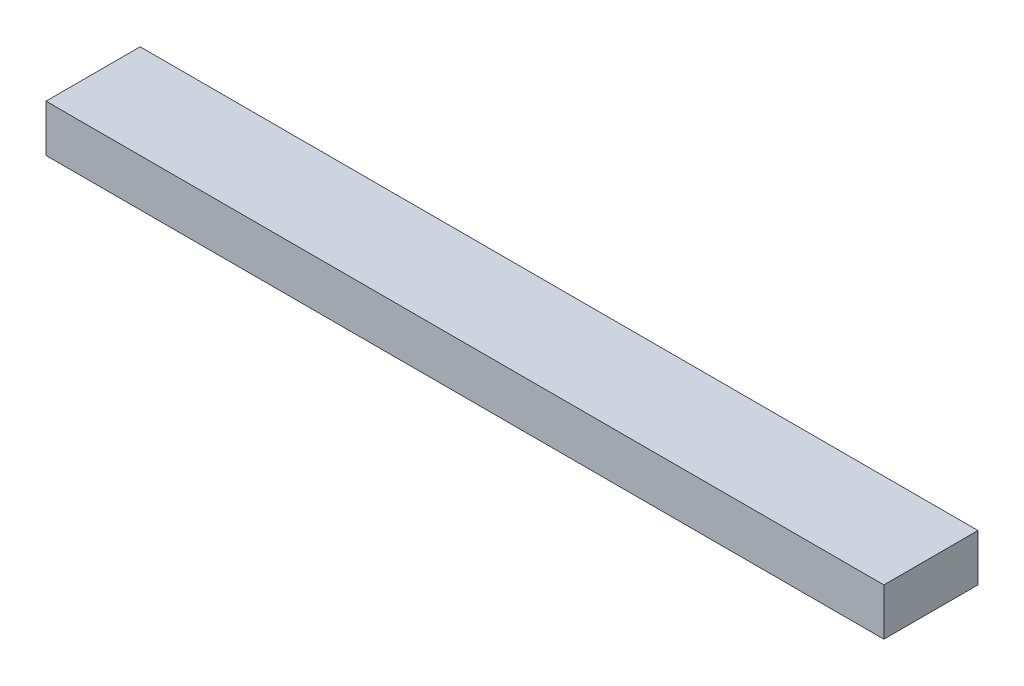
ISO-10303-21;
HEADER;
FILE_DESCRIPTION(('STEP AP214'),'2;1');
FILE_NAME('part.step','',(''),(''),'','','');
FILE_SCHEMA(('AUTOMOTIVE_DESIGN { 1 0 10303 214 1 1 1 1 }'));
ENDSEC;
DATA;
#1=APPLICATION_CONTEXT('core data for automotive mechanical design processes');
#2=APPLICATION_PROTOCOL_DEFINITION('international standard','automotive_design',2000,#1);
#3=PRODUCT_CONTEXT('',#1,'mechanical');
#4=PRODUCT('Part','Part','',(#3));
#5=PRODUCT_RELATED_PRODUCT_CATEGORY('part','',(#4));
#6=PRODUCT_DEFINITION_FORMATION('','',#4);
#7=PRODUCT_DEFINITION_CONTEXT('part definition',#1,'design');
#8=PRODUCT_DEFINITION('design','',#6,#7);
#9=PRODUCT_DEFINITION_SHAPE('','',#8);
#10=(LENGTH_UNIT() NAMED_UNIT(*) SI_UNIT(.MILLI.,.METRE.));
#11=(NAMED_UNIT(*) PLANE_ANGLE_UNIT() SI_UNIT($,.RADIAN.));
#12=(NAMED_UNIT(*) SI_UNIT($,.STERADIAN.) SOLID_ANGLE_UNIT());
#13=UNCERTAINTY_MEASURE_WITH_UNIT(LENGTH_MEASURE(1.E-05),#10,'distance_accuracy_value','');
#14=(GEOMETRIC_REPRESENTATION_CONTEXT(3) GLOBAL_UNCERTAINTY_ASSIGNED_CONTEXT((#13)) GLOBAL_UNIT_ASSIGNED_CONTEXT((#10,
#11,#12)) REPRESENTATION_CONTEXT('',''));
#15=CARTESIAN_POINT('',(0.,0.,0.));
#16=DIRECTION('',(0.,0.,1.));
#17=DIRECTION('',(1.,0.,0.));
#18=AXIS2_PLACEMENT_3D('',#15,#16,#17);
#19=CARTESIAN_POINT('',(-1780.,-50.,100.));
#20=DIRECTION('',(0.,0.,1.));
#21=DIRECTION('',(1.,0.,0.));
#22=AXIS2_PLACEMENT_3D('',#19,#20,#21);
#23=PLANE('',#22);
#24=DIRECTION('',(0.,-1.,0.));
#25=VECTOR('',#24,1.);
#26=CARTESIAN_POINT('',(0.,-50.,100.));
#27=LINE('',#26,#25);
#28=CARTESIAN_POINT('',(0.,50.,100.));
#29=VERTEX_POINT('',#28);
#30=CARTESIAN_POINT('',(0.,-50.,100.));
#31=VERTEX_POINT('',#30);
#32=EDGE_CURVE('E100',#29,#31,#27,.T.);
#33=ORIENTED_EDGE('',*,*,#32,.F.);
#34=DIRECTION('',(1.,0.,0.));
#35=VECTOR('',#34,1.);
#36=CARTESIAN_POINT('',(-1780.,50.,100.));
#37=LINE('',#36,#35);
#38=CARTESIAN_POINT('',(-1780.,50.,100.));
#39=VERTEX_POINT('',#38);
#40=EDGE_CURVE('E11',#39,#29,#37,.T.);
#41=ORIENTED_EDGE('',*,*,#40,.F.);
#42=DIRECTION('',(0.,-1.,0.));
#43=VECTOR('',#42,1.);
#44=CARTESIAN_POINT('',(-1780.,-50.,100.));
#45=LINE('',#44,#43);
#46=CARTESIAN_POINT('',(-1780.,-50.,100.));
#47=VERTEX_POINT('',#46);
#48=EDGE_CURVE('E94',#39,#47,#45,.T.);
#49=ORIENTED_EDGE('',*,*,#48,.T.);
#50=DIRECTION('',(1.,0.,0.));
#51=VECTOR('',#50,1.);
#52=CARTESIAN_POINT('',(-1780.,-50.,100.));
#53=LINE('',#52,#51);
#54=EDGE_CURVE('E39',#47,#31,#53,.T.);
#55=ORIENTED_EDGE('',*,*,#54,.T.);
#56=EDGE_LOOP('',(#33,#41,#49,#55));
#57=FACE_BOUND('',#56,.T.);
#58=ADVANCED_FACE('F36',(#57),#23,.T.);
#59=CARTESIAN_POINT('',(-1780.,50.,-100.));
#60=DIRECTION('',(0.,1.,0.));
#61=DIRECTION('',(0.,0.,1.));
#62=AXIS2_PLACEMENT_3D('',#59,#60,#61);
#63=PLANE('',#62);
#64=DIRECTION('',(0.,0.,1.));
#65=VECTOR('',#64,1.);
#66=CARTESIAN_POINT('',(0.,50.,-100.));
#67=LINE('',#66,#65);
#68=CARTESIAN_POINT('',(0.,50.,-100.));
#69=VERTEX_POINT('',#68);
#70=EDGE_CURVE('E96',#69,#29,#67,.T.);
#71=ORIENTED_EDGE('',*,*,#70,.F.);
#72=DIRECTION('',(1.,0.,0.));
#73=VECTOR('',#72,1.);
#74=CARTESIAN_POINT('',(-1780.,50.,-100.));
#75=LINE('',#74,#73);
#76=CARTESIAN_POINT('',(-1780.,50.,-100.));
#77=VERTEX_POINT('',#76);
#78=EDGE_CURVE('E45',#77,#69,#75,.T.);
#79=ORIENTED_EDGE('',*,*,#78,.F.);
#80=DIRECTION('',(0.,0.,1.));
#81=VECTOR('',#80,1.);
#82=CARTESIAN_POINT('',(-1780.,50.,-100.));
#83=LINE('',#82,#81);
#84=EDGE_CURVE('E91',#77,#39,#83,.T.);
#85=ORIENTED_EDGE('',*,*,#84,.T.);
#86=ORIENTED_EDGE('',*,*,#40,.T.);
#87=EDGE_LOOP('',(#71,#79,#85,#86));
#88=FACE_BOUND('',#87,.T.);
#89=ADVANCED_FACE('F110',(#88),#63,.T.);
#90=CARTESIAN_POINT('',(-1780.,-50.,-100.));
#91=DIRECTION('',(0.,0.,-1.));
#92=DIRECTION('',(-1.,0.,0.));
#93=AXIS2_PLACEMENT_3D('',#90,#91,#92);
#94=PLANE('',#93);
#95=DIRECTION('',(0.,1.,0.));
#96=VECTOR('',#95,1.);
#97=CARTESIAN_POINT('',(0.,-50.,-100.));
#98=LINE('',#97,#96);
#99=CARTESIAN_POINT('',(0.,-50.,-100.));
#100=VERTEX_POINT('',#99);
#101=EDGE_CURVE('E86',#100,#69,#98,.T.);
#102=ORIENTED_EDGE('',*,*,#101,.F.);
#103=DIRECTION('',(1.,0.,0.));
#104=VECTOR('',#103,1.);
#105=CARTESIAN_POINT('',(-1780.,-50.,-100.));
#106=LINE('',#105,#104);
#107=CARTESIAN_POINT('',(-1780.,-50.,-100.));
#108=VERTEX_POINT('',#107);
#109=EDGE_CURVE('E81',#108,#100,#106,.T.);
#110=ORIENTED_EDGE('',*,*,#109,.F.);
#111=DIRECTION('',(0.,1.,0.));
#112=VECTOR('',#111,1.);
#113=CARTESIAN_POINT('',(-1780.,-50.,-100.));
#114=LINE('',#113,#112);
#115=EDGE_CURVE('E84',#108,#77,#114,.T.);
#116=ORIENTED_EDGE('',*,*,#115,.T.);
#117=ORIENTED_EDGE('',*,*,#78,.T.);
#118=EDGE_LOOP('',(#102,#110,#116,#117));
#119=FACE_BOUND('',#118,.T.);
#120=ADVANCED_FACE('F83',(#119),#94,.T.);
#121=CARTESIAN_POINT('',(-1780.,-50.,-100.));
#122=DIRECTION('',(0.,-1.,0.));
#123=DIRECTION('',(0.,0.,-1.));
#124=AXIS2_PLACEMENT_3D('',#121,#122,#123);
#125=PLANE('',#124);
#126=DIRECTION('',(0.,0.,-1.));
#127=VECTOR('',#126,1.);
#128=CARTESIAN_POINT('',(0.,-50.,-100.));
#129=LINE('',#128,#127);
#130=EDGE_CURVE('E103',#31,#100,#129,.T.);
#131=ORIENTED_EDGE('',*,*,#130,.F.);
#132=ORIENTED_EDGE('',*,*,#54,.F.);
#133=DIRECTION('',(0.,0.,-1.));
#134=VECTOR('',#133,1.);
#135=CARTESIAN_POINT('',(-1780.,-50.,-100.));
#136=LINE('',#135,#134);
#137=EDGE_CURVE('E90',#47,#108,#136,.T.);
#138=ORIENTED_EDGE('',*,*,#137,.T.);
#139=ORIENTED_EDGE('',*,*,#109,.T.);
#140=EDGE_LOOP('',(#131,#132,#138,#139));
#141=FACE_BOUND('',#140,.T.);
#142=ADVANCED_FACE('F93',(#141),#125,.T.);
#143=CARTESIAN_POINT('',(-1780.,0.,0.));
#144=DIRECTION('',(1.,0.,0.));
#145=DIRECTION('',(0.,0.,-1.));
#146=AXIS2_PLACEMENT_3D('',#143,#144,#145);
#147=PLANE('',#146);
#148=ORIENTED_EDGE('',*,*,#48,.F.);
#149=ORIENTED_EDGE('',*,*,#84,.F.);
#150=ORIENTED_EDGE('',*,*,#115,.F.);
#151=ORIENTED_EDGE('',*,*,#137,.F.);
#152=EDGE_LOOP('',(#148,#149,#150,#151));
#153=FACE_BOUND('',#152,.T.);
#154=ADVANCED_FACE('F89',(#153),#147,.F.);
#155=CARTESIAN_POINT('',(0.,0.,0.));
#156=DIRECTION('',(1.,0.,0.));
#157=DIRECTION('',(0.,0.,-1.));
#158=AXIS2_PLACEMENT_3D('',#155,#156,#157);
#159=PLANE('',#158);
#160=ORIENTED_EDGE('',*,*,#32,.T.);
#161=ORIENTED_EDGE('',*,*,#130,.T.);
#162=ORIENTED_EDGE('',*,*,#101,.T.);
#163=ORIENTED_EDGE('',*,*,#70,.T.);
#164=EDGE_LOOP('',(#160,#161,#162,#163));
#165=FACE_BOUND('',#164,.T.);
#166=ADVANCED_FACE('F109',(#165),#159,.T.);
#167=CLOSED_SHELL('',(#58,#89,#120,#142,#154,#166));
#168=MANIFOLD_SOLID_BREP('B2',#167);
#169=ADVANCED_BREP_SHAPE_REPRESENTATION('',(#18,#168),#14);
#170=SHAPE_DEFINITION_REPRESENTATION(#9,#169);
ENDSEC;
END-ISO-10303-21;
